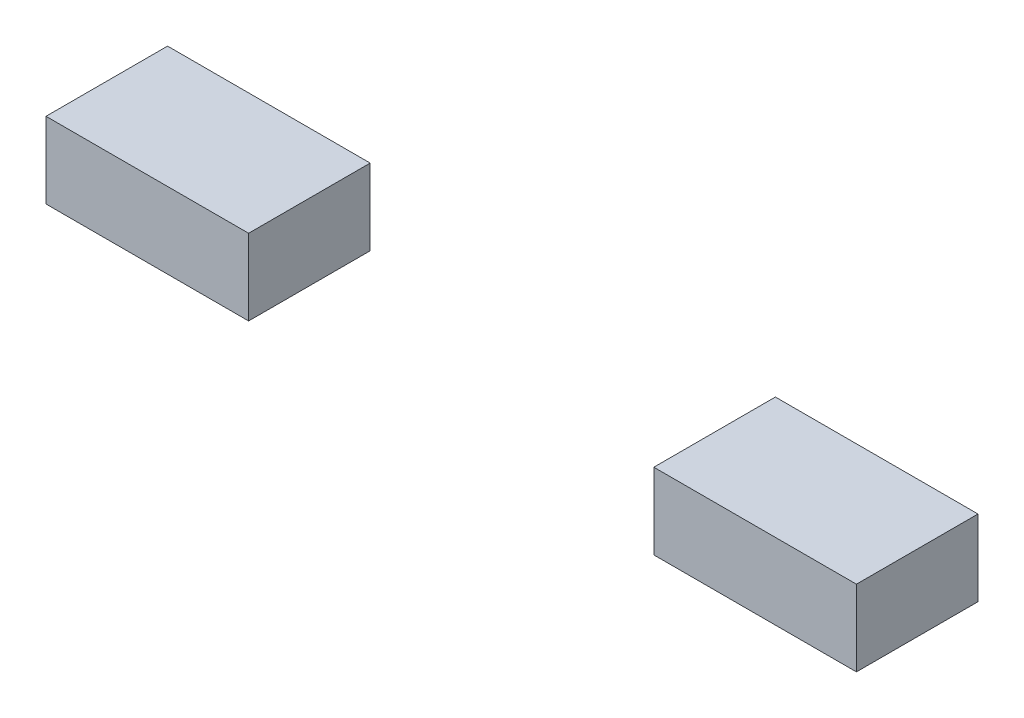
ISO-10303-21;
HEADER;
FILE_DESCRIPTION(('STEP AP214'),'2;1');
FILE_NAME('part.step','',(''),(''),'','','');
FILE_SCHEMA(('AUTOMOTIVE_DESIGN { 1 0 10303 214 1 1 1 1 }'));
ENDSEC;
DATA;
#1=APPLICATION_CONTEXT('core data for automotive mechanical design processes');
#2=APPLICATION_PROTOCOL_DEFINITION('international standard','automotive_design',2000,#1);
#3=PRODUCT_CONTEXT('',#1,'mechanical');
#4=PRODUCT('Part','Part','',(#3));
#5=PRODUCT_RELATED_PRODUCT_CATEGORY('part','',(#4));
#6=PRODUCT_DEFINITION_FORMATION('','',#4);
#7=PRODUCT_DEFINITION_CONTEXT('part definition',#1,'design');
#8=PRODUCT_DEFINITION('design','',#6,#7);
#9=PRODUCT_DEFINITION_SHAPE('','',#8);
#10=(LENGTH_UNIT() NAMED_UNIT(*) SI_UNIT(.MILLI.,.METRE.));
#11=(NAMED_UNIT(*) PLANE_ANGLE_UNIT() SI_UNIT($,.RADIAN.));
#12=(NAMED_UNIT(*) SI_UNIT($,.STERADIAN.) SOLID_ANGLE_UNIT());
#13=UNCERTAINTY_MEASURE_WITH_UNIT(LENGTH_MEASURE(1.E-05),#10,'distance_accuracy_value','');
#14=(GEOMETRIC_REPRESENTATION_CONTEXT(3) GLOBAL_UNCERTAINTY_ASSIGNED_CONTEXT((#13)) GLOBAL_UNIT_ASSIGNED_CONTEXT((#10,
#11,#12)) REPRESENTATION_CONTEXT('',''));
#15=CARTESIAN_POINT('',(0.,0.,0.));
#16=DIRECTION('',(0.,0.,1.));
#17=DIRECTION('',(1.,0.,0.));
#18=AXIS2_PLACEMENT_3D('',#15,#16,#17);
#19=CARTESIAN_POINT('',(-0.8,0.2,0.313815324666));
#20=DIRECTION('',(0.,1.,0.));
#21=DIRECTION('',(0.,0.,-1.));
#22=AXIS2_PLACEMENT_3D('',#19,#20,#21);
#23=PLANE('',#22);
#24=DIRECTION('',(0.,0.,-1.));
#25=VECTOR('',#24,1.);
#26=CARTESIAN_POINT('',(-0.4,0.2,0.156907662333));
#27=LINE('',#26,#25);
#28=CARTESIAN_POINT('',(-0.4,0.2,0.26));
#29=VERTEX_POINT('',#28);
#30=CARTESIAN_POINT('',(-0.4,0.2,0.02));
#31=VERTEX_POINT('',#30);
#32=EDGE_CURVE('P0_E41',#29,#31,#27,.T.);
#33=ORIENTED_EDGE('',*,*,#32,.F.);
#34=DIRECTION('',(1.,0.,0.));
#35=VECTOR('',#34,1.);
#36=CARTESIAN_POINT('',(0.,0.2,0.26));
#37=LINE('',#36,#35);
#38=CARTESIAN_POINT('',(-0.8,0.2,0.26));
#39=VERTEX_POINT('',#38);
#40=EDGE_CURVE('P0_E27',#39,#29,#37,.T.);
#41=ORIENTED_EDGE('',*,*,#40,.F.);
#42=DIRECTION('',(0.,0.,1.));
#43=VECTOR('',#42,1.);
#44=CARTESIAN_POINT('',(-0.8,0.2,0.156907662333));
#45=LINE('',#44,#43);
#46=CARTESIAN_POINT('',(-0.8,0.2,0.02));
#47=VERTEX_POINT('',#46);
#48=EDGE_CURVE('P0_E11',#47,#39,#45,.T.);
#49=ORIENTED_EDGE('',*,*,#48,.F.);
#50=DIRECTION('',(-1.,0.,0.));
#51=VECTOR('',#50,1.);
#52=CARTESIAN_POINT('',(0.,0.2,0.02));
#53=LINE('',#52,#51);
#54=EDGE_CURVE('P0_E62',#31,#47,#53,.T.);
#55=ORIENTED_EDGE('',*,*,#54,.F.);
#56=EDGE_LOOP('',(#33,#41,#49,#55));
#57=FACE_BOUND('',#56,.T.);
#58=ADVANCED_FACE('P0_F17',(#57),#23,.F.);
#59=CARTESIAN_POINT('',(-0.8,0.4,0.));
#60=DIRECTION('',(-1.,0.,0.));
#61=DIRECTION('',(0.,0.,1.));
#62=AXIS2_PLACEMENT_3D('',#59,#60,#61);
#63=PLANE('',#62);
#64=ORIENTED_EDGE('',*,*,#48,.T.);
#65=DIRECTION('',(0.,-1.,0.));
#66=VECTOR('',#65,1.);
#67=CARTESIAN_POINT('',(-0.8,0.2,0.26));
#68=LINE('',#67,#66);
#69=CARTESIAN_POINT('',(-0.8,0.35,0.26));
#70=VERTEX_POINT('',#69);
#71=EDGE_CURVE('P0_E90',#70,#39,#68,.T.);
#72=ORIENTED_EDGE('',*,*,#71,.F.);
#73=DIRECTION('',(0.,0.,1.));
#74=VECTOR('',#73,1.);
#75=CARTESIAN_POINT('',(-0.8,0.35,0.));
#76=LINE('',#75,#74);
#77=CARTESIAN_POINT('',(-0.8,0.35,0.02));
#78=VERTEX_POINT('',#77);
#79=EDGE_CURVE('P0_E81',#78,#70,#76,.T.);
#80=ORIENTED_EDGE('',*,*,#79,.F.);
#81=DIRECTION('',(0.,1.,0.));
#82=VECTOR('',#81,1.);
#83=CARTESIAN_POINT('',(-0.8,0.271807033082,0.02));
#84=LINE('',#83,#82);
#85=EDGE_CURVE('P0_E71',#47,#78,#84,.T.);
#86=ORIENTED_EDGE('',*,*,#85,.F.);
#87=EDGE_LOOP('',(#64,#72,#80,#86));
#88=FACE_BOUND('',#87,.T.);
#89=ADVANCED_FACE('P0_F80',(#88),#63,.T.);
#90=CARTESIAN_POINT('',(0.8,0.365,0.26));
#91=DIRECTION('',(0.,0.,1.));
#92=DIRECTION('',(1.,0.,0.));
#93=AXIS2_PLACEMENT_3D('',#90,#91,#92);
#94=PLANE('',#93);
#95=ORIENTED_EDGE('',*,*,#40,.T.);
#96=DIRECTION('',(0.,1.,0.));
#97=VECTOR('',#96,1.);
#98=CARTESIAN_POINT('',(-0.4,0.434335309942,0.26));
#99=LINE('',#98,#97);
#100=CARTESIAN_POINT('',(-0.4,0.35,0.26));
#101=VERTEX_POINT('',#100);
#102=EDGE_CURVE('P0_E92',#29,#101,#99,.T.);
#103=ORIENTED_EDGE('',*,*,#102,.T.);
#104=DIRECTION('',(1.,0.,0.));
#105=VECTOR('',#104,1.);
#106=CARTESIAN_POINT('',(-0.7,0.35,0.26));
#107=LINE('',#106,#105);
#108=EDGE_CURVE('P0_E101',#70,#101,#107,.T.);
#109=ORIENTED_EDGE('',*,*,#108,.F.);
#110=ORIENTED_EDGE('',*,*,#71,.T.);
#111=EDGE_LOOP('',(#95,#103,#109,#110));
#112=FACE_BOUND('',#111,.T.);
#113=ADVANCED_FACE('P0_F116',(#112),#94,.T.);
#114=CARTESIAN_POINT('',(-0.4,0.503670619885,0.));
#115=DIRECTION('',(-1.,0.,0.));
#116=DIRECTION('',(0.,0.,1.));
#117=AXIS2_PLACEMENT_3D('',#114,#115,#116);
#118=PLANE('',#117);
#119=ORIENTED_EDGE('',*,*,#32,.T.);
#120=DIRECTION('',(0.,-1.,0.));
#121=VECTOR('',#120,1.);
#122=CARTESIAN_POINT('',(-0.4,0.323642343024,0.02));
#123=LINE('',#122,#121);
#124=CARTESIAN_POINT('',(-0.4,0.35,0.02));
#125=VERTEX_POINT('',#124);
#126=EDGE_CURVE('P0_E20',#125,#31,#123,.T.);
#127=ORIENTED_EDGE('',*,*,#126,.F.);
#128=DIRECTION('',(0.,0.,1.));
#129=VECTOR('',#128,1.);
#130=CARTESIAN_POINT('',(-0.4,0.35,0.));
#131=LINE('',#130,#129);
#132=EDGE_CURVE('P0_E75',#125,#101,#131,.T.);
#133=ORIENTED_EDGE('',*,*,#132,.T.);
#134=ORIENTED_EDGE('',*,*,#102,.F.);
#135=EDGE_LOOP('',(#119,#127,#133,#134));
#136=FACE_BOUND('',#135,.T.);
#137=ADVANCED_FACE('P0_F118',(#136),#118,.F.);
#138=CARTESIAN_POINT('',(0.8,0.143614066163,0.02));
#139=DIRECTION('',(0.,0.,-1.));
#140=DIRECTION('',(0.,-1.,0.));
#141=AXIS2_PLACEMENT_3D('',#138,#139,#140);
#142=PLANE('',#141);
#143=ORIENTED_EDGE('',*,*,#54,.T.);
#144=ORIENTED_EDGE('',*,*,#85,.T.);
#145=DIRECTION('',(1.,0.,0.));
#146=VECTOR('',#145,1.);
#147=CARTESIAN_POINT('',(0.,0.35,0.02));
#148=LINE('',#147,#146);
#149=EDGE_CURVE('P0_E83',#78,#125,#148,.T.);
#150=ORIENTED_EDGE('',*,*,#149,.T.);
#151=ORIENTED_EDGE('',*,*,#126,.T.);
#152=EDGE_LOOP('',(#143,#144,#150,#151));
#153=FACE_BOUND('',#152,.T.);
#154=ADVANCED_FACE('P0_F68',(#153),#142,.T.);
#155=CARTESIAN_POINT('',(-0.8,0.35,0.));
#156=DIRECTION('',(0.,-1.,0.));
#157=DIRECTION('',(0.,0.,-1.));
#158=AXIS2_PLACEMENT_3D('',#155,#156,#157);
#159=PLANE('',#158);
#160=ORIENTED_EDGE('',*,*,#149,.F.);
#161=ORIENTED_EDGE('',*,*,#79,.T.);
#162=ORIENTED_EDGE('',*,*,#108,.T.);
#163=ORIENTED_EDGE('',*,*,#132,.F.);
#164=EDGE_LOOP('',(#160,#161,#162,#163));
#165=FACE_BOUND('',#164,.T.);
#166=ADVANCED_FACE('P0_F112',(#165),#159,.F.);
#167=CLOSED_SHELL('',(#58,#89,#113,#137,#154,#166));
#168=MANIFOLD_SOLID_BREP('P0_B1',#167);
#169=CARTESIAN_POINT('',(-0.8,0.35,0.));
#170=DIRECTION('',(0.,-1.,0.));
#171=DIRECTION('',(0.,0.,-1.));
#172=AXIS2_PLACEMENT_3D('',#169,#170,#171);
#173=PLANE('',#172);
#174=DIRECTION('',(1.,0.,0.));
#175=VECTOR('',#174,1.);
#176=CARTESIAN_POINT('',(0.,0.35,0.02));
#177=LINE('',#176,#175);
#178=CARTESIAN_POINT('',(0.4,0.35,0.02));
#179=VERTEX_POINT('',#178);
#180=CARTESIAN_POINT('',(0.8,0.35,0.02));
#181=VERTEX_POINT('',#180);
#182=EDGE_CURVE('P1_E40',#179,#181,#177,.T.);
#183=ORIENTED_EDGE('',*,*,#182,.F.);
#184=DIRECTION('',(0.,0.,1.));
#185=VECTOR('',#184,1.);
#186=CARTESIAN_POINT('',(0.4,0.35,0.));
#187=LINE('',#186,#185);
#188=CARTESIAN_POINT('',(0.4,0.35,0.26));
#189=VERTEX_POINT('',#188);
#190=EDGE_CURVE('P1_E11',#179,#189,#187,.T.);
#191=ORIENTED_EDGE('',*,*,#190,.T.);
#192=DIRECTION('',(1.,0.,0.));
#193=VECTOR('',#192,1.);
#194=CARTESIAN_POINT('',(-0.1,0.35,0.26));
#195=LINE('',#194,#193);
#196=CARTESIAN_POINT('',(0.8,0.35,0.26));
#197=VERTEX_POINT('',#196);
#198=EDGE_CURVE('P1_E28',#189,#197,#195,.T.);
#199=ORIENTED_EDGE('',*,*,#198,.T.);
#200=DIRECTION('',(0.,0.,-1.));
#201=VECTOR('',#200,1.);
#202=CARTESIAN_POINT('',(0.8,0.35,0.));
#203=LINE('',#202,#201);
#204=EDGE_CURVE('P1_E21',#197,#181,#203,.T.);
#205=ORIENTED_EDGE('',*,*,#204,.T.);
#206=EDGE_LOOP('',(#183,#191,#199,#205));
#207=FACE_BOUND('',#206,.T.);
#208=ADVANCED_FACE('P1_F17',(#207),#173,.F.);
#209=CARTESIAN_POINT('',(0.8,0.143614066163,0.02));
#210=DIRECTION('',(0.,0.,-1.));
#211=DIRECTION('',(0.,-1.,0.));
#212=AXIS2_PLACEMENT_3D('',#209,#210,#211);
#213=PLANE('',#212);
#214=DIRECTION('',(-1.,0.,0.));
#215=VECTOR('',#214,1.);
#216=CARTESIAN_POINT('',(0.,0.2,0.02));
#217=LINE('',#216,#215);
#218=CARTESIAN_POINT('',(0.8,0.2,0.02));
#219=VERTEX_POINT('',#218);
#220=CARTESIAN_POINT('',(0.4,0.2,0.02));
#221=VERTEX_POINT('',#220);
#222=EDGE_CURVE('P1_E75',#219,#221,#217,.T.);
#223=ORIENTED_EDGE('',*,*,#222,.T.);
#224=DIRECTION('',(0.,1.,0.));
#225=VECTOR('',#224,1.);
#226=CARTESIAN_POINT('',(0.4,-0.180028276861,0.02));
#227=LINE('',#226,#225);
#228=EDGE_CURVE('P1_E96',#221,#179,#227,.T.);
#229=ORIENTED_EDGE('',*,*,#228,.T.);
#230=ORIENTED_EDGE('',*,*,#182,.T.);
#231=DIRECTION('',(0.,-1.,0.));
#232=VECTOR('',#231,1.);
#233=CARTESIAN_POINT('',(0.8,-0.128192966918,0.02));
#234=LINE('',#233,#232);
#235=EDGE_CURVE('P1_E73',#181,#219,#234,.T.);
#236=ORIENTED_EDGE('',*,*,#235,.T.);
#237=EDGE_LOOP('',(#223,#229,#230,#236));
#238=FACE_BOUND('',#237,.T.);
#239=ADVANCED_FACE('P1_F111',(#238),#213,.T.);
#240=CARTESIAN_POINT('',(0.8,-0.4,0.));
#241=DIRECTION('',(1.,0.,0.));
#242=DIRECTION('',(0.,1.,0.));
#243=AXIS2_PLACEMENT_3D('',#240,#241,#242);
#244=PLANE('',#243);
#245=DIRECTION('',(0.,0.,-1.));
#246=VECTOR('',#245,1.);
#247=CARTESIAN_POINT('',(0.8,0.2,0.156907662333));
#248=LINE('',#247,#246);
#249=CARTESIAN_POINT('',(0.8,0.2,0.26));
#250=VERTEX_POINT('',#249);
#251=EDGE_CURVE('P1_E91',#250,#219,#248,.T.);
#252=ORIENTED_EDGE('',*,*,#251,.T.);
#253=ORIENTED_EDGE('',*,*,#235,.F.);
#254=ORIENTED_EDGE('',*,*,#204,.F.);
#255=DIRECTION('',(0.,1.,0.));
#256=VECTOR('',#255,1.);
#257=CARTESIAN_POINT('',(0.8,-0.2,0.26));
#258=LINE('',#257,#256);
#259=EDGE_CURVE('P1_E71',#250,#197,#258,.T.);
#260=ORIENTED_EDGE('',*,*,#259,.F.);
#261=EDGE_LOOP('',(#252,#253,#254,#260));
#262=FACE_BOUND('',#261,.T.);
#263=ADVANCED_FACE('P1_F69',(#262),#244,.T.);
#264=CARTESIAN_POINT('',(0.8,0.365,0.26));
#265=DIRECTION('',(0.,0.,1.));
#266=DIRECTION('',(1.,0.,0.));
#267=AXIS2_PLACEMENT_3D('',#264,#265,#266);
#268=PLANE('',#267);
#269=DIRECTION('',(1.,0.,0.));
#270=VECTOR('',#269,1.);
#271=CARTESIAN_POINT('',(0.,0.2,0.26));
#272=LINE('',#271,#270);
#273=CARTESIAN_POINT('',(0.4,0.2,0.26));
#274=VERTEX_POINT('',#273);
#275=EDGE_CURVE('P1_E83',#274,#250,#272,.T.);
#276=ORIENTED_EDGE('',*,*,#275,.T.);
#277=ORIENTED_EDGE('',*,*,#259,.T.);
#278=ORIENTED_EDGE('',*,*,#198,.F.);
#279=DIRECTION('',(0.,-1.,0.));
#280=VECTOR('',#279,1.);
#281=CARTESIAN_POINT('',(0.4,-0.06933530994244,0.26));
#282=LINE('',#281,#280);
#283=EDGE_CURVE('P1_E85',#189,#274,#282,.T.);
#284=ORIENTED_EDGE('',*,*,#283,.T.);
#285=EDGE_LOOP('',(#276,#277,#278,#284));
#286=FACE_BOUND('',#285,.T.);
#287=ADVANCED_FACE('P1_F19',(#286),#268,.T.);
#288=CARTESIAN_POINT('',(0.4,-0.503670619885,0.));
#289=DIRECTION('',(1.,0.,0.));
#290=DIRECTION('',(0.,1.,0.));
#291=AXIS2_PLACEMENT_3D('',#288,#289,#290);
#292=PLANE('',#291);
#293=DIRECTION('',(0.,0.,1.));
#294=VECTOR('',#293,1.);
#295=CARTESIAN_POINT('',(0.4,0.2,0.156907662333));
#296=LINE('',#295,#294);
#297=EDGE_CURVE('P1_E93',#221,#274,#296,.T.);
#298=ORIENTED_EDGE('',*,*,#297,.T.);
#299=ORIENTED_EDGE('',*,*,#283,.F.);
#300=ORIENTED_EDGE('',*,*,#190,.F.);
#301=ORIENTED_EDGE('',*,*,#228,.F.);
#302=EDGE_LOOP('',(#298,#299,#300,#301));
#303=FACE_BOUND('',#302,.T.);
#304=ADVANCED_FACE('P1_F117',(#303),#292,.F.);
#305=CARTESIAN_POINT('',(-0.8,0.2,0.313815324666));
#306=DIRECTION('',(0.,1.,0.));
#307=DIRECTION('',(0.,0.,-1.));
#308=AXIS2_PLACEMENT_3D('',#305,#306,#307);
#309=PLANE('',#308);
#310=ORIENTED_EDGE('',*,*,#251,.F.);
#311=ORIENTED_EDGE('',*,*,#275,.F.);
#312=ORIENTED_EDGE('',*,*,#297,.F.);
#313=ORIENTED_EDGE('',*,*,#222,.F.);
#314=EDGE_LOOP('',(#310,#311,#312,#313));
#315=FACE_BOUND('',#314,.T.);
#316=ADVANCED_FACE('P1_F115',(#315),#309,.F.);
#317=CLOSED_SHELL('',(#208,#239,#263,#287,#304,#316));
#318=MANIFOLD_SOLID_BREP('P1_B1',#317);
#319=ADVANCED_BREP_SHAPE_REPRESENTATION('',(#18,#168,#318),#14);
#320=SHAPE_DEFINITION_REPRESENTATION(#9,#319);
ENDSEC;
END-ISO-10303-21;
